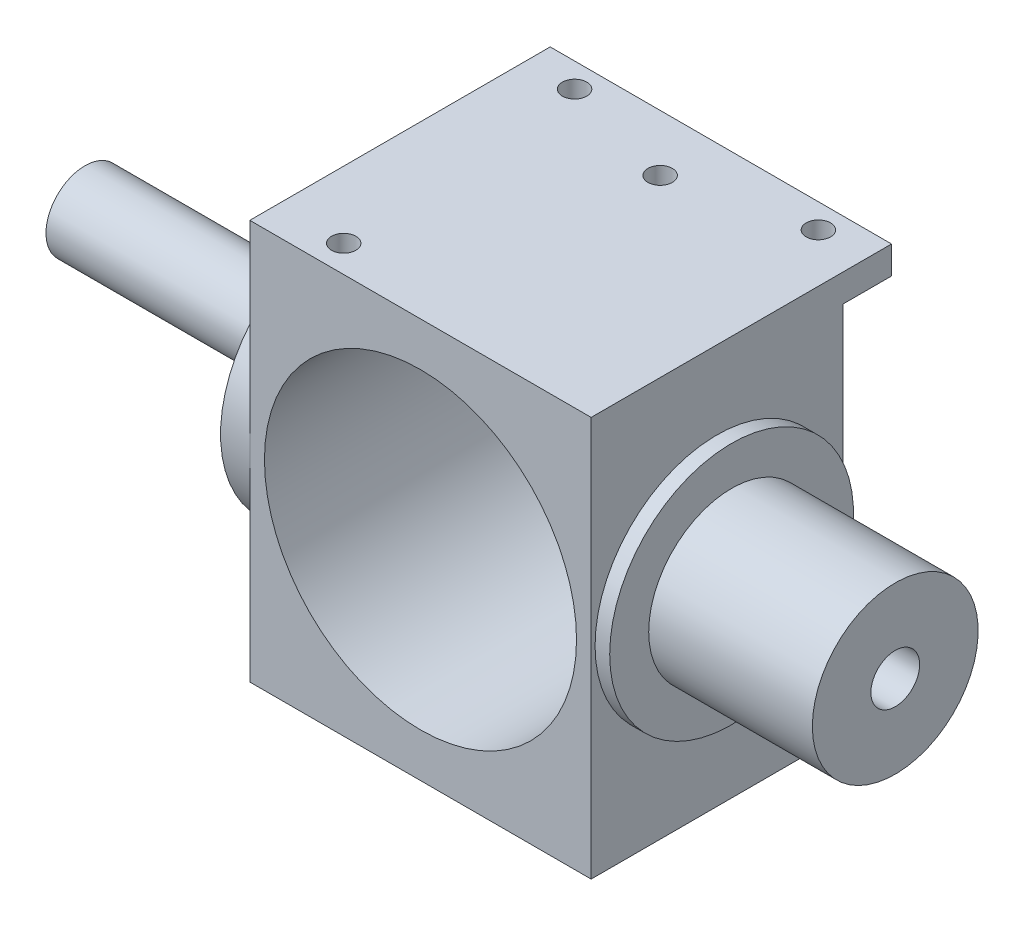
ISO-10303-21;
HEADER;
FILE_DESCRIPTION(('STEP AP214'),'2;1');
FILE_NAME('part.step','',(''),(''),'','','');
FILE_SCHEMA(('AUTOMOTIVE_DESIGN { 1 0 10303 214 1 1 1 1 }'));
ENDSEC;
DATA;
#1=APPLICATION_CONTEXT('core data for automotive mechanical design processes');
#2=APPLICATION_PROTOCOL_DEFINITION('international standard','automotive_design',2000,#1);
#3=PRODUCT_CONTEXT('',#1,'mechanical');
#4=PRODUCT('Part','Part','',(#3));
#5=PRODUCT_RELATED_PRODUCT_CATEGORY('part','',(#4));
#6=PRODUCT_DEFINITION_FORMATION('','',#4);
#7=PRODUCT_DEFINITION_CONTEXT('part definition',#1,'design');
#8=PRODUCT_DEFINITION('design','',#6,#7);
#9=PRODUCT_DEFINITION_SHAPE('','',#8);
#10=(LENGTH_UNIT() NAMED_UNIT(*) SI_UNIT(.MILLI.,.METRE.));
#11=(NAMED_UNIT(*) PLANE_ANGLE_UNIT() SI_UNIT($,.RADIAN.));
#12=(NAMED_UNIT(*) SI_UNIT($,.STERADIAN.) SOLID_ANGLE_UNIT());
#13=UNCERTAINTY_MEASURE_WITH_UNIT(LENGTH_MEASURE(1.E-05),#10,'distance_accuracy_value','');
#14=(GEOMETRIC_REPRESENTATION_CONTEXT(3) GLOBAL_UNCERTAINTY_ASSIGNED_CONTEXT((#13)) GLOBAL_UNIT_ASSIGNED_CONTEXT((#10,
#11,#12)) REPRESENTATION_CONTEXT('',''));
#15=CARTESIAN_POINT('',(0.,0.,0.));
#16=DIRECTION('',(0.,0.,1.));
#17=DIRECTION('',(1.,0.,0.));
#18=AXIS2_PLACEMENT_3D('',#15,#16,#17);
#19=CARTESIAN_POINT('',(53.5807438589496,27.618402196632,37.7129267767126));
#20=DIRECTION('',(-1.,0.,0.));
#21=DIRECTION('',(0.,0.,1.));
#22=AXIS2_PLACEMENT_3D('',#19,#20,#21);
#23=CYLINDRICAL_SURFACE('',#22,8.5);
#24=CARTESIAN_POINT('',(53.5807438589496,27.618402196632,37.7129267767126));
#25=DIRECTION('',(-1.,0.,0.));
#26=DIRECTION('',(0.,0.,1.));
#27=AXIS2_PLACEMENT_3D('',#24,#25,#26);
#28=CIRCLE('',#27,8.5);
#29=CARTESIAN_POINT('',(53.5807438589496,27.618402196632,46.2129267767126));
#30=VERTEX_POINT('',#29);
#31=EDGE_CURVE('E11',#30,#30,#28,.T.);
#32=ORIENTED_EDGE('',*,*,#31,.T.);
#33=EDGE_LOOP('',(#32));
#34=FACE_BOUND('',#33,.T.);
#35=CARTESIAN_POINT('',(36.7995438589496,27.618402196632,37.7129267767126));
#36=DIRECTION('',(-1.,0.,0.));
#37=DIRECTION('',(0.,0.,1.));
#38=AXIS2_PLACEMENT_3D('',#35,#36,#37);
#39=CIRCLE('',#38,8.5);
#40=CARTESIAN_POINT('',(36.7995438589496,27.618402196632,46.2129267767126));
#41=VERTEX_POINT('',#40);
#42=EDGE_CURVE('E55',#41,#41,#39,.T.);
#43=ORIENTED_EDGE('',*,*,#42,.F.);
#44=EDGE_LOOP('',(#43));
#45=FACE_BOUND('',#44,.T.);
#46=ADVANCED_FACE('F41',(#34,#45),#23,.T.);
#47=CARTESIAN_POINT('',(53.5807438589496,36.118402196632,37.7129267767126));
#48=DIRECTION('',(1.,0.,0.));
#49=DIRECTION('',(0.,0.,-1.));
#50=AXIS2_PLACEMENT_3D('',#47,#48,#49);
#51=PLANE('',#50);
#52=CARTESIAN_POINT('',(53.5807438589496,27.618402196632,37.7129267767126));
#53=DIRECTION('',(1.,0.,0.));
#54=DIRECTION('',(0.,0.,-1.));
#55=AXIS2_PLACEMENT_3D('',#52,#53,#54);
#56=CIRCLE('',#55,2.49999999999998);
#57=CARTESIAN_POINT('',(53.5807438589496,27.618402196632,35.2129267767126));
#58=VERTEX_POINT('',#57);
#59=EDGE_CURVE('E63',#58,#58,#56,.T.);
#60=ORIENTED_EDGE('',*,*,#59,.F.);
#61=EDGE_LOOP('',(#60));
#62=FACE_BOUND('',#61,.T.);
#63=ORIENTED_EDGE('',*,*,#31,.F.);
#64=EDGE_LOOP('',(#63));
#65=FACE_BOUND('',#64,.T.);
#66=ADVANCED_FACE('F70',(#62,#65),#51,.T.);
#67=CARTESIAN_POINT('',(35.2995438589496,27.618402196632,37.7129267767126));
#68=DIRECTION('',(-1.,0.,0.));
#69=DIRECTION('',(0.,0.,1.));
#70=AXIS2_PLACEMENT_3D('',#67,#68,#69);
#71=PLANE('',#70);
#72=CARTESIAN_POINT('',(35.2995438589496,27.618402196632,37.7129267767126));
#73=DIRECTION('',(-1.,0.,0.));
#74=DIRECTION('',(0.,0.,1.));
#75=AXIS2_PLACEMENT_3D('',#72,#73,#74);
#76=CIRCLE('',#75,2.49999999999998);
#77=CARTESIAN_POINT('',(35.2995438589496,27.618402196632,40.2129267767126));
#78=VERTEX_POINT('',#77);
#79=EDGE_CURVE('E60',#78,#78,#76,.T.);
#80=ORIENTED_EDGE('',*,*,#79,.F.);
#81=EDGE_LOOP('',(#80));
#82=FACE_BOUND('',#81,.T.);
#83=CARTESIAN_POINT('',(35.2995438589496,27.618402196632,37.7129267767126));
#84=DIRECTION('',(-1.,0.,0.));
#85=DIRECTION('',(0.,0.,1.));
#86=AXIS2_PLACEMENT_3D('',#83,#84,#85);
#87=CIRCLE('',#86,12.5);
#88=CARTESIAN_POINT('',(35.2995438589496,27.618402196632,50.2129267767126));
#89=VERTEX_POINT('',#88);
#90=EDGE_CURVE('E47',#89,#89,#87,.T.);
#91=ORIENTED_EDGE('',*,*,#90,.T.);
#92=EDGE_LOOP('',(#91));
#93=FACE_BOUND('',#92,.T.);
#94=ADVANCED_FACE('F73',(#82,#93),#71,.T.);
#95=CARTESIAN_POINT('',(53.5807438589496,27.618402196632,37.7129267767126));
#96=DIRECTION('',(-1.,0.,0.));
#97=DIRECTION('',(0.,0.,1.));
#98=AXIS2_PLACEMENT_3D('',#95,#96,#97);
#99=CYLINDRICAL_SURFACE('',#98,12.5);
#100=CARTESIAN_POINT('',(36.7995438589496,27.618402196632,37.7129267767126));
#101=DIRECTION('',(-1.,0.,0.));
#102=DIRECTION('',(0.,0.,1.));
#103=AXIS2_PLACEMENT_3D('',#100,#101,#102);
#104=CIRCLE('',#103,12.5);
#105=CARTESIAN_POINT('',(36.7995438589496,27.618402196632,50.2129267767126));
#106=VERTEX_POINT('',#105);
#107=EDGE_CURVE('E51',#106,#106,#104,.T.);
#108=ORIENTED_EDGE('',*,*,#107,.T.);
#109=EDGE_LOOP('',(#108));
#110=FACE_BOUND('',#109,.T.);
#111=ORIENTED_EDGE('',*,*,#90,.F.);
#112=EDGE_LOOP('',(#111));
#113=FACE_BOUND('',#112,.T.);
#114=ADVANCED_FACE('F78',(#110,#113),#99,.T.);
#115=CARTESIAN_POINT('',(36.7995438589496,40.118402196632,37.7129267767126));
#116=DIRECTION('',(1.,0.,0.));
#117=DIRECTION('',(0.,0.,-1.));
#118=AXIS2_PLACEMENT_3D('',#115,#116,#117);
#119=PLANE('',#118);
#120=ORIENTED_EDGE('',*,*,#42,.T.);
#121=EDGE_LOOP('',(#120));
#122=FACE_BOUND('',#121,.T.);
#123=ORIENTED_EDGE('',*,*,#107,.F.);
#124=EDGE_LOOP('',(#123));
#125=FACE_BOUND('',#124,.T.);
#126=ADVANCED_FACE('F84',(#122,#125),#119,.T.);
#127=CARTESIAN_POINT('',(53.5807438589496,27.618402196632,37.7129267767126));
#128=DIRECTION('',(1.,0.,0.));
#129=DIRECTION('',(0.,0.,-1.));
#130=AXIS2_PLACEMENT_3D('',#127,#128,#129);
#131=CYLINDRICAL_SURFACE('',#130,2.49999999999998);
#132=ORIENTED_EDGE('',*,*,#59,.T.);
#133=EDGE_LOOP('',(#132));
#134=FACE_BOUND('',#133,.T.);
#135=ORIENTED_EDGE('',*,*,#79,.T.);
#136=EDGE_LOOP('',(#135));
#137=FACE_BOUND('',#136,.T.);
#138=ADVANCED_FACE('F67',(#134,#137),#131,.F.);
#139=CLOSED_SHELL('',(#46,#66,#94,#114,#126,#138));
#140=MANIFOLD_SOLID_BREP('B2',#139);
#141=CARTESIAN_POINT('',(0.,0.,19.8129267767126));
#142=DIRECTION('',(0.,0.,-1.));
#143=DIRECTION('',(-1.,0.,0.));
#144=AXIS2_PLACEMENT_3D('',#141,#142,#143);
#145=PLANE('',#144);
#146=DIRECTION('',(-1.,0.,0.));
#147=VECTOR('',#146,1.);
#148=CARTESIAN_POINT('',(0.,10.118402196632,19.8129267767126));
#149=LINE('',#148,#147);
#150=CARTESIAN_POINT('',(35.2995438589496,10.118402196632,19.8129267767126));
#151=VERTEX_POINT('',#150);
#152=CARTESIAN_POINT('',(0.299543858949605,10.118402196632,19.8129267767126));
#153=VERTEX_POINT('',#152);
#154=EDGE_CURVE('E152',#151,#153,#149,.T.);
#155=ORIENTED_EDGE('',*,*,#154,.F.);
#156=DIRECTION('',(0.,-1.,0.));
#157=VECTOR('',#156,1.);
#158=CARTESIAN_POINT('',(35.2995438589496,48.118402196632,19.8129267767126));
#159=LINE('',#158,#157);
#160=CARTESIAN_POINT('',(35.2995438589496,7.11840219663202,19.8129267767126));
#161=VERTEX_POINT('',#160);
#162=EDGE_CURVE('E279',#151,#161,#159,.T.);
#163=ORIENTED_EDGE('',*,*,#162,.T.);
#164=DIRECTION('',(-1.,0.,0.));
#165=VECTOR('',#164,1.);
#166=CARTESIAN_POINT('',(35.2995438589496,7.11840219663202,19.8129267767126));
#167=LINE('',#166,#165);
#168=CARTESIAN_POINT('',(0.299543858949612,7.11840219663202,19.8129267767126));
#169=VERTEX_POINT('',#168);
#170=EDGE_CURVE('E263',#161,#169,#167,.T.);
#171=ORIENTED_EDGE('',*,*,#170,.T.);
#172=DIRECTION('',(0.,1.,0.));
#173=VECTOR('',#172,1.);
#174=CARTESIAN_POINT('',(0.299543858949612,7.11840219663202,19.8129267767126));
#175=LINE('',#174,#173);
#176=EDGE_CURVE('E273',#169,#153,#175,.T.);
#177=ORIENTED_EDGE('',*,*,#176,.T.);
#178=EDGE_LOOP('',(#155,#163,#171,#177));
#179=FACE_BOUND('',#178,.T.);
#180=ADVANCED_FACE('F139',(#179),#145,.T.);
#181=CARTESIAN_POINT('',(0.299543858949612,7.11840219663202,50.6129267767126));
#182=DIRECTION('',(-1.,0.,0.));
#183=DIRECTION('',(0.,-1.,0.));
#184=AXIS2_PLACEMENT_3D('',#181,#182,#183);
#185=PLANE('',#184);
#186=DIRECTION('',(0.,0.,1.));
#187=VECTOR('',#186,1.);
#188=CARTESIAN_POINT('',(0.299543858949612,10.118402196632,50.6129267767126));
#189=LINE('',#188,#187);
#190=CARTESIAN_POINT('',(0.299543858949609,10.118402196632,24.8129267767126));
#191=VERTEX_POINT('',#190);
#192=EDGE_CURVE('E254',#153,#191,#189,.T.);
#193=ORIENTED_EDGE('',*,*,#192,.F.);
#194=ORIENTED_EDGE('',*,*,#176,.F.);
#195=DIRECTION('',(0.,0.,-1.));
#196=VECTOR('',#195,1.);
#197=CARTESIAN_POINT('',(0.299543858949612,7.11840219663202,50.6129267767126));
#198=LINE('',#197,#196);
#199=CARTESIAN_POINT('',(0.299543858949612,7.11840219663202,50.6129267767126));
#200=VERTEX_POINT('',#199);
#201=EDGE_CURVE('E285',#200,#169,#198,.T.);
#202=ORIENTED_EDGE('',*,*,#201,.F.);
#203=DIRECTION('',(0.,1.,0.));
#204=VECTOR('',#203,1.);
#205=CARTESIAN_POINT('',(0.299543858949612,7.11840219663202,50.6129267767126));
#206=LINE('',#205,#204);
#207=CARTESIAN_POINT('',(0.299543858949605,48.118402196632,50.6129267767126));
#208=VERTEX_POINT('',#207);
#209=EDGE_CURVE('E259',#200,#208,#206,.T.);
#210=ORIENTED_EDGE('',*,*,#209,.T.);
#211=DIRECTION('',(0.,0.,-1.));
#212=VECTOR('',#211,1.);
#213=CARTESIAN_POINT('',(0.299543858949605,48.118402196632,50.6129267767126));
#214=LINE('',#213,#212);
#215=CARTESIAN_POINT('',(0.299543858949605,48.118402196632,19.8129267767126));
#216=VERTEX_POINT('',#215);
#217=EDGE_CURVE('E272',#208,#216,#214,.T.);
#218=ORIENTED_EDGE('',*,*,#217,.T.);
#219=CARTESIAN_POINT('',(0.299543858949606,45.272002196632,19.8129267767126));
#220=VERTEX_POINT('',#219);
#221=EDGE_CURVE('E258',#220,#216,#175,.T.);
#222=ORIENTED_EDGE('',*,*,#221,.F.);
#223=DIRECTION('',(0.,0.,-1.));
#224=VECTOR('',#223,1.);
#225=CARTESIAN_POINT('',(0.299543858949606,45.272002196632,50.6129267767126));
#226=LINE('',#225,#224);
#227=CARTESIAN_POINT('',(0.299543858949605,45.272002196632,24.8129267767126));
#228=VERTEX_POINT('',#227);
#229=EDGE_CURVE('E166',#228,#220,#226,.T.);
#230=ORIENTED_EDGE('',*,*,#229,.F.);
#231=DIRECTION('',(0.,1.,0.));
#232=VECTOR('',#231,1.);
#233=CARTESIAN_POINT('',(0.299543858949612,7.11840219663202,24.8129267767126));
#234=LINE('',#233,#232);
#235=EDGE_CURVE('E256',#191,#228,#234,.T.);
#236=ORIENTED_EDGE('',*,*,#235,.F.);
#237=EDGE_LOOP('',(#193,#194,#202,#210,#218,#222,#230,#236));
#238=FACE_BOUND('',#237,.T.);
#239=ADVANCED_FACE('F345',(#238),#185,.T.);
#240=CARTESIAN_POINT('',(35.2995438589496,7.11840219663202,50.6129267767126));
#241=DIRECTION('',(0.,-1.,0.));
#242=DIRECTION('',(0.,0.,-1.));
#243=AXIS2_PLACEMENT_3D('',#240,#241,#242);
#244=PLANE('',#243);
#245=CARTESIAN_POINT('',(5.29954385894961,7.11840219663201,22.3129267767126));
#246=DIRECTION('',(0.,1.,0.));
#247=DIRECTION('',(0.,0.,1.));
#248=AXIS2_PLACEMENT_3D('',#245,#246,#247);
#249=CIRCLE('',#248,1.24999999999997);
#250=CARTESIAN_POINT('',(5.29954385894961,7.11840219663201,23.5629267767126));
#251=VERTEX_POINT('',#250);
#252=EDGE_CURVE('E409',#251,#251,#249,.T.);
#253=ORIENTED_EDGE('',*,*,#252,.T.);
#254=EDGE_LOOP('',(#253));
#255=FACE_BOUND('',#254,.T.);
#256=CARTESIAN_POINT('',(30.2995438589496,7.11840219663202,22.3129267767126));
#257=DIRECTION('',(0.,1.,0.));
#258=DIRECTION('',(0.,0.,1.));
#259=AXIS2_PLACEMENT_3D('',#256,#257,#258);
#260=CIRCLE('',#259,1.24999999999997);
#261=CARTESIAN_POINT('',(30.2995438589496,7.11840219663201,23.5629267767126));
#262=VERTEX_POINT('',#261);
#263=EDGE_CURVE('E403',#262,#262,#260,.T.);
#264=ORIENTED_EDGE('',*,*,#263,.T.);
#265=EDGE_LOOP('',(#264));
#266=FACE_BOUND('',#265,.T.);
#267=ORIENTED_EDGE('',*,*,#170,.F.);
#268=DIRECTION('',(0.,0.,-1.));
#269=VECTOR('',#268,1.);
#270=CARTESIAN_POINT('',(35.2995438589496,7.11840219663202,50.6129267767126));
#271=LINE('',#270,#269);
#272=CARTESIAN_POINT('',(35.2995438589496,7.11840219663202,50.6129267767126));
#273=VERTEX_POINT('',#272);
#274=EDGE_CURVE('E288',#273,#161,#271,.T.);
#275=ORIENTED_EDGE('',*,*,#274,.F.);
#276=DIRECTION('',(-1.,0.,0.));
#277=VECTOR('',#276,1.);
#278=CARTESIAN_POINT('',(35.2995438589496,7.11840219663202,50.6129267767126));
#279=LINE('',#278,#277);
#280=EDGE_CURVE('E269',#273,#200,#279,.T.);
#281=ORIENTED_EDGE('',*,*,#280,.T.);
#282=ORIENTED_EDGE('',*,*,#201,.T.);
#283=EDGE_LOOP('',(#267,#275,#281,#282));
#284=FACE_BOUND('',#283,.T.);
#285=ADVANCED_FACE('F352',(#255,#266,#284),#244,.T.);
#286=CARTESIAN_POINT('',(35.2995438589496,48.118402196632,50.6129267767126));
#287=DIRECTION('',(1.,0.,0.));
#288=DIRECTION('',(0.,1.,0.));
#289=AXIS2_PLACEMENT_3D('',#286,#287,#288);
#290=PLANE('',#289);
#291=CARTESIAN_POINT('',(35.2995438589496,27.618402196632,37.7129267767126));
#292=DIRECTION('',(1.,0.,0.));
#293=DIRECTION('',(0.,1.,0.));
#294=AXIS2_PLACEMENT_3D('',#291,#292,#293);
#295=CIRCLE('',#294,2.49999999999998);
#296=CARTESIAN_POINT('',(35.2995438589496,30.118402196632,37.7129267767126));
#297=VERTEX_POINT('',#296);
#298=EDGE_CURVE('E240',#297,#297,#295,.T.);
#299=ORIENTED_EDGE('',*,*,#298,.F.);
#300=EDGE_LOOP('',(#299));
#301=FACE_BOUND('',#300,.T.);
#302=DIRECTION('',(0.,0.,-1.));
#303=VECTOR('',#302,1.);
#304=CARTESIAN_POINT('',(35.2995438589496,10.118402196632,24.8129267767126));
#305=LINE('',#304,#303);
#306=CARTESIAN_POINT('',(35.2995438589496,10.118402196632,24.8129267767126));
#307=VERTEX_POINT('',#306);
#308=EDGE_CURVE('E234',#307,#151,#305,.T.);
#309=ORIENTED_EDGE('',*,*,#308,.F.);
#310=DIRECTION('',(0.,-1.,0.));
#311=VECTOR('',#310,1.);
#312=CARTESIAN_POINT('',(35.2995438589496,45.272002196632,24.8129267767126));
#313=LINE('',#312,#311);
#314=CARTESIAN_POINT('',(35.2995438589496,45.272002196632,24.8129267767126));
#315=VERTEX_POINT('',#314);
#316=EDGE_CURVE('E246',#315,#307,#313,.T.);
#317=ORIENTED_EDGE('',*,*,#316,.F.);
#318=DIRECTION('',(0.,0.,1.));
#319=VECTOR('',#318,1.);
#320=CARTESIAN_POINT('',(35.2995438589496,45.272002196632,19.8129267767126));
#321=LINE('',#320,#319);
#322=CARTESIAN_POINT('',(35.2995438589496,45.272002196632,19.8129267767126));
#323=VERTEX_POINT('',#322);
#324=EDGE_CURVE('E237',#323,#315,#321,.T.);
#325=ORIENTED_EDGE('',*,*,#324,.F.);
#326=CARTESIAN_POINT('',(35.2995438589496,48.118402196632,19.8129267767126));
#327=VERTEX_POINT('',#326);
#328=EDGE_CURVE('E280',#327,#323,#159,.T.);
#329=ORIENTED_EDGE('',*,*,#328,.F.);
#330=DIRECTION('',(0.,0.,-1.));
#331=VECTOR('',#330,1.);
#332=CARTESIAN_POINT('',(35.2995438589496,48.118402196632,50.6129267767126));
#333=LINE('',#332,#331);
#334=CARTESIAN_POINT('',(35.2995438589496,48.118402196632,50.6129267767126));
#335=VERTEX_POINT('',#334);
#336=EDGE_CURVE('E291',#335,#327,#333,.T.);
#337=ORIENTED_EDGE('',*,*,#336,.F.);
#338=DIRECTION('',(0.,-1.,0.));
#339=VECTOR('',#338,1.);
#340=CARTESIAN_POINT('',(35.2995438589496,48.118402196632,50.6129267767126));
#341=LINE('',#340,#339);
#342=EDGE_CURVE('E266',#335,#273,#341,.T.);
#343=ORIENTED_EDGE('',*,*,#342,.T.);
#344=ORIENTED_EDGE('',*,*,#274,.T.);
#345=ORIENTED_EDGE('',*,*,#162,.F.);
#346=EDGE_LOOP('',(#309,#317,#325,#329,#337,#343,#344,#345));
#347=FACE_BOUND('',#346,.T.);
#348=ADVANCED_FACE('F381',(#301,#347),#290,.T.);
#349=CARTESIAN_POINT('',(0.299543858949605,48.118402196632,50.6129267767126));
#350=DIRECTION('',(0.,1.,0.));
#351=DIRECTION('',(0.,0.,1.));
#352=AXIS2_PLACEMENT_3D('',#349,#350,#351);
#353=PLANE('',#352);
#354=CARTESIAN_POINT('',(5.29954385894961,48.118402196632,22.3129267767126));
#355=DIRECTION('',(0.,-1.,0.));
#356=DIRECTION('',(0.,0.,-1.));
#357=AXIS2_PLACEMENT_3D('',#354,#355,#356);
#358=CIRCLE('',#357,1.24999999999998);
#359=CARTESIAN_POINT('',(5.29954385894961,48.118402196632,21.0629267767126));
#360=VERTEX_POINT('',#359);
#361=EDGE_CURVE('E397',#360,#360,#358,.T.);
#362=ORIENTED_EDGE('',*,*,#361,.T.);
#363=EDGE_LOOP('',(#362));
#364=FACE_BOUND('',#363,.T.);
#365=CARTESIAN_POINT('',(30.2995438589496,48.118402196632,22.3129267767126));
#366=DIRECTION('',(0.,-1.,0.));
#367=DIRECTION('',(0.,0.,-1.));
#368=AXIS2_PLACEMENT_3D('',#365,#366,#367);
#369=CIRCLE('',#368,1.24999999999998);
#370=CARTESIAN_POINT('',(30.2995438589496,48.118402196632,21.0629267767126));
#371=VERTEX_POINT('',#370);
#372=EDGE_CURVE('E391',#371,#371,#369,.T.);
#373=ORIENTED_EDGE('',*,*,#372,.T.);
#374=EDGE_LOOP('',(#373));
#375=FACE_BOUND('',#374,.T.);
#376=CARTESIAN_POINT('',(17.3495438589496,48.118402196632,25.5879267767126));
#377=DIRECTION('',(0.,1.,0.));
#378=DIRECTION('',(0.,0.,1.));
#379=AXIS2_PLACEMENT_3D('',#376,#377,#378);
#380=CIRCLE('',#379,1.24999999999999);
#381=CARTESIAN_POINT('',(17.3495438589496,48.118402196632,26.8379267767126));
#382=VERTEX_POINT('',#381);
#383=EDGE_CURVE('E231',#382,#382,#380,.T.);
#384=ORIENTED_EDGE('',*,*,#383,.F.);
#385=EDGE_LOOP('',(#384));
#386=FACE_BOUND('',#385,.T.);
#387=CARTESIAN_POINT('',(7.1495438589496,48.118402196632,47.8379267767126));
#388=DIRECTION('',(0.,1.,0.));
#389=DIRECTION('',(0.,0.,1.));
#390=AXIS2_PLACEMENT_3D('',#387,#388,#389);
#391=CIRCLE('',#390,1.24999999999998);
#392=CARTESIAN_POINT('',(7.1495438589496,48.118402196632,49.0879267767126));
#393=VERTEX_POINT('',#392);
#394=EDGE_CURVE('E305',#393,#393,#391,.T.);
#395=ORIENTED_EDGE('',*,*,#394,.F.);
#396=EDGE_LOOP('',(#395));
#397=FACE_BOUND('',#396,.T.);
#398=DIRECTION('',(1.,0.,0.));
#399=VECTOR('',#398,1.);
#400=CARTESIAN_POINT('',(0.299543858949605,48.118402196632,19.8129267767126));
#401=LINE('',#400,#399);
#402=EDGE_CURVE('E276',#216,#327,#401,.T.);
#403=ORIENTED_EDGE('',*,*,#402,.F.);
#404=ORIENTED_EDGE('',*,*,#217,.F.);
#405=DIRECTION('',(1.,0.,0.));
#406=VECTOR('',#405,1.);
#407=CARTESIAN_POINT('',(0.299543858949605,48.118402196632,50.6129267767126));
#408=LINE('',#407,#406);
#409=EDGE_CURVE('E262',#208,#335,#408,.T.);
#410=ORIENTED_EDGE('',*,*,#409,.T.);
#411=ORIENTED_EDGE('',*,*,#336,.T.);
#412=EDGE_LOOP('',(#403,#404,#410,#411));
#413=FACE_BOUND('',#412,.T.);
#414=ADVANCED_FACE('F367',(#364,#375,#386,#397,#413),#353,.T.);
#415=CARTESIAN_POINT('',(0.,0.,50.6129267767126));
#416=DIRECTION('',(0.,0.,-1.));
#417=DIRECTION('',(-1.,0.,0.));
#418=AXIS2_PLACEMENT_3D('',#415,#416,#417);
#419=PLANE('',#418);
#420=CARTESIAN_POINT('',(17.7995438589496,27.618402196632,50.6129267767126));
#421=DIRECTION('',(0.,0.,1.));
#422=DIRECTION('',(1.,0.,0.));
#423=AXIS2_PLACEMENT_3D('',#420,#421,#422);
#424=CIRCLE('',#423,16.);
#425=CARTESIAN_POINT('',(33.7995438589496,27.618402196632,50.6129267767126));
#426=VERTEX_POINT('',#425);
#427=EDGE_CURVE('E235',#426,#426,#424,.T.);
#428=ORIENTED_EDGE('',*,*,#427,.F.);
#429=EDGE_LOOP('',(#428));
#430=FACE_BOUND('',#429,.T.);
#431=ORIENTED_EDGE('',*,*,#209,.F.);
#432=ORIENTED_EDGE('',*,*,#280,.F.);
#433=ORIENTED_EDGE('',*,*,#342,.F.);
#434=ORIENTED_EDGE('',*,*,#409,.F.);
#435=EDGE_LOOP('',(#431,#432,#433,#434));
#436=FACE_BOUND('',#435,.T.);
#437=ADVANCED_FACE('F359',(#430,#436),#419,.F.);
#438=DIRECTION('',(1.,0.,0.));
#439=VECTOR('',#438,1.);
#440=CARTESIAN_POINT('',(0.,45.272002196632,19.8129267767126));
#441=LINE('',#440,#439);
#442=EDGE_CURVE('E287',#220,#323,#441,.T.);
#443=ORIENTED_EDGE('',*,*,#442,.F.);
#444=ORIENTED_EDGE('',*,*,#221,.T.);
#445=ORIENTED_EDGE('',*,*,#402,.T.);
#446=ORIENTED_EDGE('',*,*,#328,.T.);
#447=EDGE_LOOP('',(#443,#444,#445,#446));
#448=FACE_BOUND('',#447,.T.);
#449=ADVANCED_FACE('F348',(#448),#145,.T.);
#450=CARTESIAN_POINT('',(-29.5004561410504,10.118402196632,24.8129267767126));
#451=DIRECTION('',(0.,-1.,0.));
#452=DIRECTION('',(0.,0.,-1.));
#453=AXIS2_PLACEMENT_3D('',#450,#451,#452);
#454=PLANE('',#453);
#455=CARTESIAN_POINT('',(5.29954385894961,10.118402196632,22.3129267767126));
#456=DIRECTION('',(0.,1.,0.));
#457=DIRECTION('',(0.,0.,1.));
#458=AXIS2_PLACEMENT_3D('',#455,#456,#457);
#459=CIRCLE('',#458,1.24999999999997);
#460=CARTESIAN_POINT('',(5.29954385894961,10.118402196632,23.5629267767126));
#461=VERTEX_POINT('',#460);
#462=EDGE_CURVE('E412',#461,#461,#459,.T.);
#463=ORIENTED_EDGE('',*,*,#462,.F.);
#464=EDGE_LOOP('',(#463));
#465=FACE_BOUND('',#464,.T.);
#466=CARTESIAN_POINT('',(30.2995438589496,10.118402196632,22.3129267767126));
#467=DIRECTION('',(0.,1.,0.));
#468=DIRECTION('',(0.,0.,1.));
#469=AXIS2_PLACEMENT_3D('',#466,#467,#468);
#470=CIRCLE('',#469,1.24999999999997);
#471=CARTESIAN_POINT('',(30.2995438589496,10.118402196632,23.5629267767126));
#472=VERTEX_POINT('',#471);
#473=EDGE_CURVE('E406',#472,#472,#470,.T.);
#474=ORIENTED_EDGE('',*,*,#473,.F.);
#475=EDGE_LOOP('',(#474));
#476=FACE_BOUND('',#475,.T.);
#477=ORIENTED_EDGE('',*,*,#192,.T.);
#478=DIRECTION('',(1.,0.,0.));
#479=VECTOR('',#478,1.);
#480=CARTESIAN_POINT('',(-29.5004561410504,10.118402196632,24.8129267767126));
#481=LINE('',#480,#479);
#482=EDGE_CURVE('E250',#191,#307,#481,.T.);
#483=ORIENTED_EDGE('',*,*,#482,.T.);
#484=ORIENTED_EDGE('',*,*,#308,.T.);
#485=ORIENTED_EDGE('',*,*,#154,.T.);
#486=EDGE_LOOP('',(#477,#483,#484,#485));
#487=FACE_BOUND('',#486,.T.);
#488=ADVANCED_FACE('F358',(#465,#476,#487),#454,.F.);
#489=CARTESIAN_POINT('',(-29.5004561410504,45.272002196632,24.8129267767126));
#490=DIRECTION('',(0.,0.,1.));
#491=DIRECTION('',(1.,0.,0.));
#492=AXIS2_PLACEMENT_3D('',#489,#490,#491);
#493=PLANE('',#492);
#494=CARTESIAN_POINT('',(17.7995438589496,27.618402196632,24.8129267767126));
#495=DIRECTION('',(0.,0.,1.));
#496=DIRECTION('',(1.,0.,0.));
#497=AXIS2_PLACEMENT_3D('',#494,#495,#496);
#498=CIRCLE('',#497,16.);
#499=CARTESIAN_POINT('',(16.3687915966529,43.554303425114,24.8129267767126));
#500=VERTEX_POINT('',#499);
#501=CARTESIAN_POINT('',(18.3302961212462,43.6095967122418,24.8129267767126));
#502=VERTEX_POINT('',#501);
#503=EDGE_CURVE('E228',#500,#502,#498,.T.);
#504=ORIENTED_EDGE('',*,*,#503,.T.);
#505=DIRECTION('',(0.,1.,0.));
#506=VECTOR('',#505,1.);
#507=CARTESIAN_POINT('',(18.3302961212462,48.118402196632,24.8129267767126));
#508=LINE('',#507,#506);
#509=CARTESIAN_POINT('',(18.3302961212462,45.272002196632,24.8129267767126));
#510=VERTEX_POINT('',#509);
#511=EDGE_CURVE('E159',#502,#510,#508,.T.);
#512=ORIENTED_EDGE('',*,*,#511,.T.);
#513=DIRECTION('',(1.,0.,0.));
#514=VECTOR('',#513,1.);
#515=CARTESIAN_POINT('',(-29.5004561410504,45.272002196632,24.8129267767126));
#516=LINE('',#515,#514);
#517=EDGE_CURVE('E249',#510,#315,#516,.T.);
#518=ORIENTED_EDGE('',*,*,#517,.T.);
#519=ORIENTED_EDGE('',*,*,#316,.T.);
#520=ORIENTED_EDGE('',*,*,#482,.F.);
#521=ORIENTED_EDGE('',*,*,#235,.T.);
#522=CARTESIAN_POINT('',(16.3687915966529,45.272002196632,24.8129267767126));
#523=VERTEX_POINT('',#522);
#524=EDGE_CURVE('E229',#228,#523,#516,.T.);
#525=ORIENTED_EDGE('',*,*,#524,.T.);
#526=DIRECTION('',(0.,1.,0.));
#527=VECTOR('',#526,1.);
#528=CARTESIAN_POINT('',(16.3687915966529,48.118402196632,24.8129267767126));
#529=LINE('',#528,#527);
#530=EDGE_CURVE('E220',#523,#500,#529,.F.);
#531=ORIENTED_EDGE('',*,*,#530,.T.);
#532=EDGE_LOOP('',(#504,#512,#518,#519,#520,#521,#525,#531));
#533=FACE_BOUND('',#532,.T.);
#534=ADVANCED_FACE('F227',(#533),#493,.F.);
#535=CARTESIAN_POINT('',(-29.5004561410504,45.272002196632,19.8129267767126));
#536=DIRECTION('',(0.,1.,0.));
#537=DIRECTION('',(-1.,0.,0.));
#538=AXIS2_PLACEMENT_3D('',#535,#536,#537);
#539=PLANE('',#538);
#540=CARTESIAN_POINT('',(5.29954385894961,45.272002196632,22.3129267767126));
#541=DIRECTION('',(0.,-1.,0.));
#542=DIRECTION('',(0.,0.,-1.));
#543=AXIS2_PLACEMENT_3D('',#540,#541,#542);
#544=CIRCLE('',#543,1.24999999999998);
#545=CARTESIAN_POINT('',(5.29954385894961,45.272002196632,21.0629267767126));
#546=VERTEX_POINT('',#545);
#547=EDGE_CURVE('E400',#546,#546,#544,.T.);
#548=ORIENTED_EDGE('',*,*,#547,.F.);
#549=EDGE_LOOP('',(#548));
#550=FACE_BOUND('',#549,.T.);
#551=CARTESIAN_POINT('',(30.2995438589496,45.272002196632,22.3129267767126));
#552=DIRECTION('',(0.,-1.,0.));
#553=DIRECTION('',(0.,0.,-1.));
#554=AXIS2_PLACEMENT_3D('',#551,#552,#553);
#555=CIRCLE('',#554,1.24999999999998);
#556=CARTESIAN_POINT('',(30.2995438589496,45.272002196632,21.0629267767126));
#557=VERTEX_POINT('',#556);
#558=EDGE_CURVE('E394',#557,#557,#555,.T.);
#559=ORIENTED_EDGE('',*,*,#558,.F.);
#560=EDGE_LOOP('',(#559));
#561=FACE_BOUND('',#560,.T.);
#562=ORIENTED_EDGE('',*,*,#517,.F.);
#563=CARTESIAN_POINT('',(17.3495438589496,45.272002196632,25.5879267767126));
#564=DIRECTION('',(0.,1.,0.));
#565=DIRECTION('',(-1.,0.,0.));
#566=AXIS2_PLACEMENT_3D('',#563,#564,#565);
#567=CIRCLE('',#566,1.24999999999999);
#568=EDGE_CURVE('E230',#510,#523,#567,.T.);
#569=ORIENTED_EDGE('',*,*,#568,.T.);
#570=ORIENTED_EDGE('',*,*,#524,.F.);
#571=ORIENTED_EDGE('',*,*,#229,.T.);
#572=ORIENTED_EDGE('',*,*,#442,.T.);
#573=ORIENTED_EDGE('',*,*,#324,.T.);
#574=EDGE_LOOP('',(#562,#569,#570,#571,#572,#573));
#575=FACE_BOUND('',#574,.T.);
#576=ADVANCED_FACE('F384',(#550,#561,#575),#539,.F.);
#577=CARTESIAN_POINT('',(17.7995438589496,27.618402196632,50.6129267767126));
#578=DIRECTION('',(0.,0.,1.));
#579=DIRECTION('',(1.,0.,0.));
#580=AXIS2_PLACEMENT_3D('',#577,#578,#579);
#581=CYLINDRICAL_SURFACE('',#580,16.);
#582=CARTESIAN_POINT('',(7.1495438589496,39.5589842594965,49.0879267767126));
#583=CARTESIAN_POINT('',(7.22841025100024,39.6293251701633,49.0879275253317));
#584=CARTESIAN_POINT('',(7.30801002333441,39.698910166747,49.08047969827));
#585=CARTESIAN_POINT('',(7.46693001150936,39.8351136817398,49.0496689824288));
#586=CARTESIAN_POINT('',(7.54624984198888,39.9017289803233,49.0262892464861));
#587=CARTESIAN_POINT('',(7.68975799179025,40.0199943000132,48.9673982728999));
#588=CARTESIAN_POINT('',(7.75437030918428,40.0723540012027,48.9343609677214));
#589=CARTESIAN_POINT('',(7.87937715397783,40.1721529773538,48.8554186510015));
#590=CARTESIAN_POINT('',(7.93977830909945,40.2196000438861,48.8095344568639));
#591=CARTESIAN_POINT('',(8.04276631192002,40.2994395481597,48.7146130681844));
#592=CARTESIAN_POINT('',(8.08655324117426,40.3329771122049,48.6678478873446));
#593=CARTESIAN_POINT('',(8.16778471078857,40.3946228060148,48.5658877298161));
#594=CARTESIAN_POINT('',(8.20523034999038,40.4227318765673,48.5106942167782));
#595=CARTESIAN_POINT('',(8.27201780499601,40.472506841842,48.3921953522042));
#596=CARTESIAN_POINT('',(8.30128811795272,40.4941160060748,48.3288251076241));
#597=CARTESIAN_POINT('',(8.34919589073696,40.5293209234379,48.196107665322));
#598=CARTESIAN_POINT('',(8.36784493226361,40.5429254056111,48.1267670731977));
#599=CARTESIAN_POINT('',(8.39114320016101,40.5598924741225,47.9951784021133));
#600=CARTESIAN_POINT('',(8.39743922291544,40.5644606379411,47.9333734130613));
#601=CARTESIAN_POINT('',(8.40075279348468,40.5668667450301,47.8093958469466));
#602=CARTESIAN_POINT('',(8.39777496674115,40.5647080434035,47.7472234685632));
#603=CARTESIAN_POINT('',(8.38334866905531,40.5542181614103,47.6294308083059));
#604=CARTESIAN_POINT('',(8.37258362792708,40.5463849207979,47.5736793567642));
#605=CARTESIAN_POINT('',(8.34396222356784,40.5254656824477,47.4650743830946));
#606=CARTESIAN_POINT('',(8.32610549028107,40.512379410598,47.4122210123571));
#607=CARTESIAN_POINT('',(8.28334498692651,40.4808548240629,47.3085258478892));
#608=CARTESIAN_POINT('',(8.25818969789309,40.4622247385429,47.2578471001296));
#609=CARTESIAN_POINT('',(8.20230107823198,40.4205170932762,47.1616876948797));
#610=CARTESIAN_POINT('',(8.17156587882845,40.3974380433598,47.1162087872172));
#611=CARTESIAN_POINT('',(8.10134576865354,40.344247170049,47.025347406109));
#612=CARTESIAN_POINT('',(8.06124242559233,40.3136105796767,46.9807524146164));
#613=CARTESIAN_POINT('',(7.97684548102725,40.2484240475169,46.8990281016199));
#614=CARTESIAN_POINT('',(7.93254845026406,40.2138708984492,46.8619049688993));
#615=CARTESIAN_POINT('',(7.81961523435933,40.1247326528481,46.7794290813128));
#616=CARTESIAN_POINT('',(7.74928034563387,40.0683333193814,46.7383400798698));
#617=CARTESIAN_POINT('',(7.6054217740488,39.95082067727,46.6713099764106));
#618=CARTESIAN_POINT('',(7.5318934842693,39.8897004520584,46.6453915963067));
#619=CARTESIAN_POINT('',(7.38288887726279,39.7634819211845,46.6074635743204));
#620=CARTESIAN_POINT('',(7.30739969500392,39.6983399901176,46.5956531662439));
#621=CARTESIAN_POINT('',(7.15718685347285,39.5662162814578,46.5856843743714));
#622=CARTESIAN_POINT('',(7.08246332223114,39.4992342028366,46.5875282376759));
#623=CARTESIAN_POINT('',(6.91951180305149,39.3503879507891,46.6059935028791));
#624=CARTESIAN_POINT('',(6.83176211160093,39.2683664850097,46.6256516282157));
#625=CARTESIAN_POINT('',(6.66133793649691,39.105536022258,46.6836889019518));
#626=CARTESIAN_POINT('',(6.57866491578456,39.0247273798062,46.722073418485));
#627=CARTESIAN_POINT('',(6.43830312811785,38.8847138147371,46.807484169759));
#628=CARTESIAN_POINT('',(6.37913112623724,38.8246817970776,46.8507248449842));
#629=CARTESIAN_POINT('',(6.26696272096157,38.7092092340625,46.9495991043031));
#630=CARTESIAN_POINT('',(6.21395505594591,38.6537603711311,47.0052095307402));
#631=CARTESIAN_POINT('',(6.13101740222701,38.5659134165647,47.1111616260617));
#632=CARTESIAN_POINT('',(6.09890763765558,38.5315586189827,47.1581675970786));
#633=CARTESIAN_POINT('',(6.04022893092636,38.468303741791,47.2588726012257));
#634=CARTESIAN_POINT('',(6.01365193214192,38.4393957366561,47.3125617178046));
#635=CARTESIAN_POINT('',(5.97245995508199,38.3943394137828,47.4144479850031));
#636=CARTESIAN_POINT('',(5.95650734785193,38.3767882823249,47.4614763656665));
#637=CARTESIAN_POINT('',(5.93006427076985,38.3476074193715,47.5588117203578));
#638=CARTESIAN_POINT('',(5.91956915507387,38.3359726515913,47.60911586461));
#639=CARTESIAN_POINT('',(5.90479866785438,38.3195780633947,47.7121089936214));
#640=CARTESIAN_POINT('',(5.90056510508215,38.3148644574719,47.7648116084974));
#641=CARTESIAN_POINT('',(5.89885201901788,38.3129586031203,47.8704596380682));
#642=CARTESIAN_POINT('',(5.90137083096406,38.3157645007981,47.9234049897047));
#643=CARTESIAN_POINT('',(5.91231678050375,38.3279253282249,48.0222889647668));
#644=CARTESIAN_POINT('',(5.92011141338537,38.33657901696,48.0683892581831));
#645=CARTESIAN_POINT('',(5.94039892872743,38.359021805115,48.158227751732));
#646=CARTESIAN_POINT('',(5.95289387106696,38.3728131560552,48.2019649066102));
#647=CARTESIAN_POINT('',(5.98734876645245,38.4106640631441,48.3022171082816));
#648=CARTESIAN_POINT('',(6.01110089364877,38.4366348479417,48.3573928539733));
#649=CARTESIAN_POINT('',(6.06452385931679,38.4945626035896,48.4613572409776));
#650=CARTESIAN_POINT('',(6.09420670064754,38.5265317059906,48.5101325917028));
#651=CARTESIAN_POINT('',(6.17129496245318,38.6087683708878,48.6200435683575));
#652=CARTESIAN_POINT('',(6.22096517015398,38.661150209285,48.6779987903182));
#653=CARTESIAN_POINT('',(6.3267767978002,38.7710469336774,48.7818917912596));
#654=CARTESIAN_POINT('',(6.38293255031589,38.8285731225007,48.827802190824));
#655=CARTESIAN_POINT('',(6.51923298766611,38.9659448808494,48.9214910875595));
#656=CARTESIAN_POINT('',(6.60120687301811,39.046925059265,48.9649481359937));
#657=CARTESIAN_POINT('',(6.77074093327827,39.2106145811297,49.0326314192226));
#658=CARTESIAN_POINT('',(6.85829159626268,39.2933208266517,49.0568894991045));
#659=CARTESIAN_POINT('',(7.01408372181703,39.437119089,49.0823876313112));
#660=CARTESIAN_POINT('',(7.08154116421908,39.498332677108,49.0879261312143));
#661=CARTESIAN_POINT('',(7.1495438589496,39.5589842594965,49.0879267767126));
#662=B_SPLINE_CURVE_WITH_KNOTS('',3,(#582,#583,#584,#585,#586,#587,#588,#589,#590,#591,#592,
#593,#594,#595,#596,#597,#598,#599,#600,#601,#602,#603,#604,#605,#606,#607,#608,#609,#610,#611,
#612,#613,#614,#615,#616,#617,#618,#619,#620,#621,#622,#623,#624,#625,#626,#627,#628,#629,#630,
#631,#632,#633,#634,#635,#636,#637,#638,#639,#640,#641,#642,#643,#644,#645,#646,#647,#648,#649,
#650,#651,#652,#653,#654,#655,#656,#657,#658,#659,#660,#661),.UNSPECIFIED.,.T.,.F.,(4,2,2,2,2,2,
2,2,2,2,2,2,2,2,2,2,2,2,2,2,2,2,2,2,2,2,2,2,2,2,2,2,2,2,2,2,2,2,2,4),(0.,0.316814175904855,
0.633963887220631,0.901435157842406,1.1684754954178,1.38456423085952,1.60061548326066,
1.81850106767839,2.03614860708912,2.22201079301226,2.40778029283002,2.57896409915326,
2.75015683929324,2.92814275109768,3.10618838275649,3.30747462438697,3.50892690722588,
3.80453994105443,4.10059460601332,4.40078253410515,4.70101986559696,5.06462343256464,
5.42833129194084,5.71164548914288,5.99443368671965,6.19328291343825,6.3918405253364,
6.54923647496252,6.70649821658051,6.86480533659751,7.02307343043248,7.16510825347536,
7.30720539497996,7.50245010582682,7.69809403933429,7.97429766100385,8.25112379294263,
8.61869949574288,8.98566422005234,9.25883783849965),.UNSPECIFIED.);
#663=CARTESIAN_POINT('',(7.1495438589496,39.5589842594965,49.0879267767126));
#664=VERTEX_POINT('',#663);
#665=EDGE_CURVE('E301',#664,#664,#662,.T.);
#666=ORIENTED_EDGE('',*,*,#665,.T.);
#667=EDGE_LOOP('',(#666));
#668=FACE_BOUND('',#667,.T.);
#669=ORIENTED_EDGE('',*,*,#427,.T.);
#670=EDGE_LOOP('',(#669));
#671=FACE_BOUND('',#670,.T.);
#672=ORIENTED_EDGE('',*,*,#503,.F.);
#673=CARTESIAN_POINT('',(16.3687915966529,43.554303425114,24.8129267767126));
#674=CARTESIAN_POINT('',(16.3470555958181,43.552351773371,24.8404339301807));
#675=CARTESIAN_POINT('',(16.3264852357546,43.550460293576,24.8688453221694));
#676=CARTESIAN_POINT('',(16.2877984372048,43.5468360107551,24.9273009818201));
#677=CARTESIAN_POINT('',(16.2696819470202,43.5451032043864,24.9573452150626));
#678=CARTESIAN_POINT('',(16.2192440052578,43.5402048404949,25.049577674157));
#679=CARTESIAN_POINT('',(16.1907713010789,43.5373335448865,25.1139452454446));
#680=CARTESIAN_POINT('',(16.1450040461206,43.5326421069366,25.2465834351924));
#681=CARTESIAN_POINT('',(16.1277162131873,43.5308225963871,25.3148563725488));
#682=CARTESIAN_POINT('',(16.1048313179303,43.5284016810724,25.453345970764));
#683=CARTESIAN_POINT('',(16.0992309935825,43.527799936426,25.5235620837304));
#684=CARTESIAN_POINT('',(16.0998827567662,43.5278695689244,25.6637023386862));
#685=CARTESIAN_POINT('',(16.1060955607488,43.5285367264455,25.733626676139));
#686=CARTESIAN_POINT('',(16.1301133516421,43.531074679085,25.8714447583443));
#687=CARTESIAN_POINT('',(16.1479203087023,43.532945678767,25.9393381559359));
#688=CARTESIAN_POINT('',(16.194605599654,43.5377212696764,26.0711509094684));
#689=CARTESIAN_POINT('',(16.2234819506855,43.5406256757831,26.1350709747703));
#690=CARTESIAN_POINT('',(16.2914755139076,43.5472091652997,26.2571604132863));
#691=CARTESIAN_POINT('',(16.3305923189259,43.5508882179076,26.3153300150188));
#692=CARTESIAN_POINT('',(16.4181671265433,43.558720079748,26.4245630948589));
#693=CARTESIAN_POINT('',(16.4666676402443,43.562875008498,26.475592339571));
#694=CARTESIAN_POINT('',(16.5715292108036,43.5712935073739,26.5688011594896));
#695=CARTESIAN_POINT('',(16.6278906193149,43.5755570823531,26.6109803385816));
#696=CARTESIAN_POINT('',(16.747106548918,43.5838634510737,26.6854354692875));
#697=CARTESIAN_POINT('',(16.8099831227411,43.5879054191424,26.7176762140382));
#698=CARTESIAN_POINT('',(16.9402912100834,43.5954463473251,26.7711306809631));
#699=CARTESIAN_POINT('',(17.0077226536761,43.5989453157725,26.7923445723782));
#700=CARTESIAN_POINT('',(17.145128383849,43.6051611138204,26.8231043368117));
#701=CARTESIAN_POINT('',(17.2150988170127,43.6078790770762,26.8326671877546));
#702=CARTESIAN_POINT('',(17.3556806445187,43.6123988944274,26.8398915928367));
#703=CARTESIAN_POINT('',(17.4262920259262,43.6142007669687,26.8375533866208));
#704=CARTESIAN_POINT('',(17.5658823539597,43.6168477375432,26.8210607817274));
#705=CARTESIAN_POINT('',(17.6348662360259,43.6176962346432,26.8069486762187));
#706=CARTESIAN_POINT('',(17.769496996323,43.6185156902505,26.7673598900674));
#707=CARTESIAN_POINT('',(17.8351438957903,43.6184866543431,26.7418832817582));
#708=CARTESIAN_POINT('',(17.9611773467712,43.6177099039483,26.6803181067481));
#709=CARTESIAN_POINT('',(18.0215686248416,43.616962842644,26.6442392055924));
#710=CARTESIAN_POINT('',(18.1354526791286,43.6149772764805,26.5624835357937));
#711=CARTESIAN_POINT('',(18.1889453587379,43.61373876474,26.5168066327649));
#712=CARTESIAN_POINT('',(18.287617585924,43.6110326982966,26.4170519932389));
#713=CARTESIAN_POINT('',(18.3327814451594,43.6095647207814,26.3629587497145));
#714=CARTESIAN_POINT('',(18.4133972825201,43.6066734107369,26.2479621880788));
#715=CARTESIAN_POINT('',(18.4488491696758,43.6052500786257,26.1870588061861));
#716=CARTESIAN_POINT('',(18.5090709268702,43.6026909002911,26.0600912940928));
#717=CARTESIAN_POINT('',(18.5338287182624,43.6015553797367,25.9940214274249));
#718=CARTESIAN_POINT('',(18.5718965516394,43.5997612622435,25.8586597948608));
#719=CARTESIAN_POINT('',(18.5852073024519,43.5991026357748,25.7893682287399));
#720=CARTESIAN_POINT('',(18.5999952841497,43.5983688284465,25.6496067116069));
#721=CARTESIAN_POINT('',(18.6014852058601,43.5982930218751,25.5791381057665));
#722=CARTESIAN_POINT('',(18.5926180075804,43.5987354877604,25.4389254714714));
#723=CARTESIAN_POINT('',(18.5822569708835,43.5992539566235,25.3691816902581));
#724=CARTESIAN_POINT('',(18.5499880566041,43.6008016583793,25.2324371490002));
#725=CARTESIAN_POINT('',(18.5280799510801,43.6018309013547,25.1654364431326));
#726=CARTESIAN_POINT('',(18.4733460184998,43.6042313422569,25.0361283368703));
#727=CARTESIAN_POINT('',(18.4405374703457,43.6056019981357,24.9738136988333));
#728=CARTESIAN_POINT('',(18.3915653731996,43.6074495630204,24.8971813642279));
#729=CARTESIAN_POINT('',(18.3798920658255,43.6078781777285,24.8798879108123));
#730=CARTESIAN_POINT('',(18.3557144283795,43.6087374262501,24.8459341672868));
#731=CARTESIAN_POINT('',(18.3432114717955,43.6091680556813,24.8292728990989));
#732=CARTESIAN_POINT('',(18.3302961212462,43.6095967122418,24.8129267767126));
#733=B_SPLINE_CURVE_WITH_KNOTS('',3,(#673,#674,#675,#676,#677,#678,#679,#680,#681,#682,#683,
#684,#685,#686,#687,#688,#689,#690,#691,#692,#693,#694,#695,#696,#697,#698,#699,#700,#701,#702,
#703,#704,#705,#706,#707,#708,#709,#710,#711,#712,#713,#714,#715,#716,#717,#718,#719,#720,#721,
#722,#723,#724,#725,#726,#727,#728,#729,#730,#731,#732),.UNSPECIFIED.,.F.,.F.,(4,2,2,2,2,2,2,2,
2,2,2,2,2,2,2,2,2,2,2,2,2,2,2,2,2,2,2,2,2,4),(0.,0.105274204101358,0.210546189932064,
0.420789422495154,0.631158814197986,0.841469483219326,1.05108200500612,1.26073015473451,
1.47034076773599,1.67994304764414,1.89051811826017,2.10110261186459,2.31242474735667,
2.5237436393669,2.73475422725081,2.94576056615004,3.15601219366487,3.36626248297843,
3.57632168981316,3.78638383797601,3.99683770986433,4.20729355295802,4.41798648171531,
4.6286663629337,4.83912002788745,5.04964326726078,5.26017066256328,5.47036591874527,
5.53295519355891,5.59544331899557),.UNSPECIFIED.);
#734=EDGE_CURVE('E39',#500,#502,#733,.T.);
#735=ORIENTED_EDGE('',*,*,#734,.T.);
#736=EDGE_LOOP('',(#672,#735));
#737=FACE_BOUND('',#736,.T.);
#738=ADVANCED_FACE('F233',(#668,#671,#737),#581,.F.);
#739=CARTESIAN_POINT('',(35.2985438589496,27.618402196632,37.7129267767126));
#740=DIRECTION('',(-1.,0.,0.));
#741=DIRECTION('',(0.,0.,1.));
#742=AXIS2_PLACEMENT_3D('',#739,#740,#741);
#743=PLANE('',#742);
#744=CARTESIAN_POINT('',(35.2985438589496,27.618402196632,37.7129267767126));
#745=DIRECTION('',(1.,0.,0.));
#746=DIRECTION('',(0.,0.,-1.));
#747=AXIS2_PLACEMENT_3D('',#744,#745,#746);
#748=CIRCLE('',#747,2.49999999999998);
#749=CARTESIAN_POINT('',(35.2985438589496,27.618402196632,35.2129267767126));
#750=VERTEX_POINT('',#749);
#751=EDGE_CURVE('E297',#750,#750,#748,.T.);
#752=ORIENTED_EDGE('',*,*,#751,.T.);
#753=EDGE_LOOP('',(#752));
#754=FACE_BOUND('',#753,.T.);
#755=ADVANCED_FACE('F455',(#754),#743,.F.);
#756=CARTESIAN_POINT('',(53.5807438589496,27.618402196632,37.7129267767126));
#757=DIRECTION('',(1.,0.,0.));
#758=DIRECTION('',(0.,0.,-1.));
#759=AXIS2_PLACEMENT_3D('',#756,#757,#758);
#760=CYLINDRICAL_SURFACE('',#759,2.49999999999998);
#761=ORIENTED_EDGE('',*,*,#298,.T.);
#762=EDGE_LOOP('',(#761));
#763=FACE_BOUND('',#762,.T.);
#764=ORIENTED_EDGE('',*,*,#751,.F.);
#765=EDGE_LOOP('',(#764));
#766=FACE_BOUND('',#765,.T.);
#767=ADVANCED_FACE('F320',(#763,#766),#760,.F.);
#768=CARTESIAN_POINT('',(7.1495438589496,48.118402196632,47.8379267767126));
#769=DIRECTION('',(0.,1.,0.));
#770=DIRECTION('',(0.,0.,1.));
#771=AXIS2_PLACEMENT_3D('',#768,#769,#770);
#772=CYLINDRICAL_SURFACE('',#771,1.24999999999997);
#773=ORIENTED_EDGE('',*,*,#665,.F.);
#774=EDGE_LOOP('',(#773));
#775=FACE_BOUND('',#774,.T.);
#776=ORIENTED_EDGE('',*,*,#394,.T.);
#777=EDGE_LOOP('',(#776));
#778=FACE_BOUND('',#777,.T.);
#779=ADVANCED_FACE('F316',(#775,#778),#772,.F.);
#780=CARTESIAN_POINT('',(17.3495438589496,48.118402196632,25.5879267767126));
#781=DIRECTION('',(0.,1.,0.));
#782=DIRECTION('',(0.,0.,1.));
#783=AXIS2_PLACEMENT_3D('',#780,#781,#782);
#784=CYLINDRICAL_SURFACE('',#783,1.24999999999999);
#785=ORIENTED_EDGE('',*,*,#383,.T.);
#786=EDGE_LOOP('',(#785));
#787=FACE_BOUND('',#786,.T.);
#788=ORIENTED_EDGE('',*,*,#734,.F.);
#789=ORIENTED_EDGE('',*,*,#530,.F.);
#790=ORIENTED_EDGE('',*,*,#568,.F.);
#791=ORIENTED_EDGE('',*,*,#511,.F.);
#792=EDGE_LOOP('',(#788,#789,#790,#791));
#793=FACE_BOUND('',#792,.T.);
#794=ADVANCED_FACE('F219',(#787,#793),#784,.F.);
#795=CARTESIAN_POINT('',(30.2995438589496,45.272002196632,22.3129267767126));
#796=DIRECTION('',(0.,-1.,0.));
#797=DIRECTION('',(0.,0.,-1.));
#798=AXIS2_PLACEMENT_3D('',#795,#796,#797);
#799=CYLINDRICAL_SURFACE('',#798,1.24999999999998);
#800=ORIENTED_EDGE('',*,*,#372,.F.);
#801=EDGE_LOOP('',(#800));
#802=FACE_BOUND('',#801,.T.);
#803=ORIENTED_EDGE('',*,*,#558,.T.);
#804=EDGE_LOOP('',(#803));
#805=FACE_BOUND('',#804,.T.);
#806=ADVANCED_FACE('F324',(#802,#805),#799,.F.);
#807=CARTESIAN_POINT('',(5.29954385894961,45.272002196632,22.3129267767126));
#808=DIRECTION('',(0.,-1.,0.));
#809=DIRECTION('',(0.,0.,-1.));
#810=AXIS2_PLACEMENT_3D('',#807,#808,#809);
#811=CYLINDRICAL_SURFACE('',#810,1.24999999999998);
#812=ORIENTED_EDGE('',*,*,#361,.F.);
#813=EDGE_LOOP('',(#812));
#814=FACE_BOUND('',#813,.T.);
#815=ORIENTED_EDGE('',*,*,#547,.T.);
#816=EDGE_LOOP('',(#815));
#817=FACE_BOUND('',#816,.T.);
#818=ADVANCED_FACE('F328',(#814,#817),#811,.F.);
#819=CARTESIAN_POINT('',(30.2995438589496,10.118402196632,22.3129267767126));
#820=DIRECTION('',(0.,1.,0.));
#821=DIRECTION('',(0.,0.,1.));
#822=AXIS2_PLACEMENT_3D('',#819,#820,#821);
#823=CYLINDRICAL_SURFACE('',#822,1.24999999999997);
#824=ORIENTED_EDGE('',*,*,#263,.F.);
#825=EDGE_LOOP('',(#824));
#826=FACE_BOUND('',#825,.T.);
#827=ORIENTED_EDGE('',*,*,#473,.T.);
#828=EDGE_LOOP('',(#827));
#829=FACE_BOUND('',#828,.T.);
#830=ADVANCED_FACE('F332',(#826,#829),#823,.F.);
#831=CARTESIAN_POINT('',(5.29954385894961,10.118402196632,22.3129267767126));
#832=DIRECTION('',(0.,1.,0.));
#833=DIRECTION('',(0.,0.,1.));
#834=AXIS2_PLACEMENT_3D('',#831,#832,#833);
#835=CYLINDRICAL_SURFACE('',#834,1.24999999999997);
#836=ORIENTED_EDGE('',*,*,#252,.F.);
#837=EDGE_LOOP('',(#836));
#838=FACE_BOUND('',#837,.T.);
#839=ORIENTED_EDGE('',*,*,#462,.T.);
#840=EDGE_LOOP('',(#839));
#841=FACE_BOUND('',#840,.T.);
#842=ADVANCED_FACE('F336',(#838,#841),#835,.F.);
#843=CLOSED_SHELL('',(#180,#239,#285,#348,#414,#437,#449,#488,#534,#576,#738,#755,#767,#779,
#794,#806,#818,#830,#842));
#844=MANIFOLD_SOLID_BREP('B6',#843);
#845=CARTESIAN_POINT('',(-29.5004561410504,27.618402196632,37.7129267767126));
#846=DIRECTION('',(1.,0.,0.));
#847=DIRECTION('',(0.,1.,0.));
#848=AXIS2_PLACEMENT_3D('',#845,#846,#847);
#849=CYLINDRICAL_SURFACE('',#848,4.00000000000001);
#850=CARTESIAN_POINT('',(-29.5004561410504,27.618402196632,37.7129267767126));
#851=DIRECTION('',(1.,0.,0.));
#852=DIRECTION('',(0.,1.,0.));
#853=AXIS2_PLACEMENT_3D('',#850,#851,#852);
#854=CIRCLE('',#853,4.00000000000001);
#855=CARTESIAN_POINT('',(-29.5004561410504,31.618402196632,37.7129267767126));
#856=VERTEX_POINT('',#855);
#857=EDGE_CURVE('E138',#856,#856,#854,.T.);
#858=ORIENTED_EDGE('',*,*,#857,.T.);
#859=EDGE_LOOP('',(#858));
#860=FACE_BOUND('',#859,.T.);
#861=CARTESIAN_POINT('',(-4.20045614100673,27.618402196632,37.7129267767126));
#862=DIRECTION('',(1.,0.,0.));
#863=DIRECTION('',(0.,1.,0.));
#864=AXIS2_PLACEMENT_3D('',#861,#862,#863);
#865=CIRCLE('',#864,4.00000000000001);
#866=CARTESIAN_POINT('',(-4.20045614100673,31.618402196632,37.7129267767126));
#867=VERTEX_POINT('',#866);
#868=EDGE_CURVE('E593',#867,#867,#865,.T.);
#869=ORIENTED_EDGE('',*,*,#868,.F.);
#870=EDGE_LOOP('',(#869));
#871=FACE_BOUND('',#870,.T.);
#872=ADVANCED_FACE('F574',(#860,#871),#849,.T.);
#873=CARTESIAN_POINT('',(-29.5004561410504,31.618402196632,37.7129267767126));
#874=DIRECTION('',(-1.,0.,0.));
#875=DIRECTION('',(0.,-1.,0.));
#876=AXIS2_PLACEMENT_3D('',#873,#874,#875);
#877=PLANE('',#876);
#878=ORIENTED_EDGE('',*,*,#857,.F.);
#879=EDGE_LOOP('',(#878));
#880=FACE_BOUND('',#879,.T.);
#881=ADVANCED_FACE('F601',(#880),#877,.T.);
#882=CARTESIAN_POINT('',(0.299543858949607,27.618402196632,37.7129267767126));
#883=DIRECTION('',(1.,0.,0.));
#884=DIRECTION('',(0.,1.,0.));
#885=AXIS2_PLACEMENT_3D('',#882,#883,#884);
#886=PLANE('',#885);
#887=CARTESIAN_POINT('',(0.299543858949609,27.618402196632,37.7129267767126));
#888=DIRECTION('',(1.,0.,0.));
#889=DIRECTION('',(0.,1.,0.));
#890=AXIS2_PLACEMENT_3D('',#887,#888,#889);
#891=CIRCLE('',#890,12.8999999999034);
#892=CARTESIAN_POINT('',(0.299543858949604,40.5184021965354,37.7129267767126));
#893=VERTEX_POINT('',#892);
#894=EDGE_CURVE('E580',#893,#893,#891,.T.);
#895=ORIENTED_EDGE('',*,*,#894,.T.);
#896=EDGE_LOOP('',(#895));
#897=FACE_BOUND('',#896,.T.);
#898=ADVANCED_FACE('F605',(#897),#886,.T.);
#899=CARTESIAN_POINT('',(-29.5004561410504,27.618402196632,37.7129267767126));
#900=DIRECTION('',(1.,0.,0.));
#901=DIRECTION('',(0.,1.,0.));
#902=AXIS2_PLACEMENT_3D('',#899,#900,#901);
#903=CYLINDRICAL_SURFACE('',#902,12.8999999999034);
#904=CARTESIAN_POINT('',(-2.70045614114602,27.618402196632,37.7129267767126));
#905=DIRECTION('',(1.,0.,0.));
#906=DIRECTION('',(0.,1.,0.));
#907=AXIS2_PLACEMENT_3D('',#904,#905,#906);
#908=CIRCLE('',#907,12.8999999999034);
#909=CARTESIAN_POINT('',(-2.70045614114602,40.5184021965354,37.7129267767126));
#910=VERTEX_POINT('',#909);
#911=EDGE_CURVE('E584',#910,#910,#908,.T.);
#912=ORIENTED_EDGE('',*,*,#911,.T.);
#913=EDGE_LOOP('',(#912));
#914=FACE_BOUND('',#913,.T.);
#915=ORIENTED_EDGE('',*,*,#894,.F.);
#916=EDGE_LOOP('',(#915));
#917=FACE_BOUND('',#916,.T.);
#918=ADVANCED_FACE('F610',(#914,#917),#903,.T.);
#919=CARTESIAN_POINT('',(-2.70045614114602,40.5184021965354,37.7129267767126));
#920=DIRECTION('',(-1.,0.,0.));
#921=DIRECTION('',(0.,-1.,0.));
#922=AXIS2_PLACEMENT_3D('',#919,#920,#921);
#923=PLANE('',#922);
#924=CARTESIAN_POINT('',(-2.70045614114602,27.618402196632,37.7129267767126));
#925=DIRECTION('',(1.,0.,0.));
#926=DIRECTION('',(0.,1.,0.));
#927=AXIS2_PLACEMENT_3D('',#924,#925,#926);
#928=CIRCLE('',#927,5.49999999986071);
#929=CARTESIAN_POINT('',(-2.70045614114602,33.1184021964927,37.7129267767126));
#930=VERTEX_POINT('',#929);
#931=EDGE_CURVE('E588',#930,#930,#928,.T.);
#932=ORIENTED_EDGE('',*,*,#931,.T.);
#933=EDGE_LOOP('',(#932));
#934=FACE_BOUND('',#933,.T.);
#935=ORIENTED_EDGE('',*,*,#911,.F.);
#936=EDGE_LOOP('',(#935));
#937=FACE_BOUND('',#936,.T.);
#938=ADVANCED_FACE('F615',(#934,#937),#923,.T.);
#939=CARTESIAN_POINT('',(-2.70045614114602,27.618402196632,37.7129267767126));
#940=DIRECTION('',(1.,0.,0.));
#941=DIRECTION('',(0.,1.,0.));
#942=AXIS2_PLACEMENT_3D('',#939,#940,#941);
#943=CONICAL_SURFACE('',#942,5.49999999986071,0.785398163397447);
#944=ORIENTED_EDGE('',*,*,#868,.T.);
#945=EDGE_LOOP('',(#944));
#946=FACE_BOUND('',#945,.T.);
#947=ORIENTED_EDGE('',*,*,#931,.F.);
#948=EDGE_LOOP('',(#947));
#949=FACE_BOUND('',#948,.T.);
#950=ADVANCED_FACE('F597',(#946,#949),#943,.T.);
#951=CLOSED_SHELL('',(#872,#881,#898,#918,#938,#950));
#952=MANIFOLD_SOLID_BREP('B33',#951);
#953=ADVANCED_BREP_SHAPE_REPRESENTATION('',(#18,#140,#844,#952),#14);
#954=SHAPE_DEFINITION_REPRESENTATION(#9,#953);
ENDSEC;
END-ISO-10303-21;
